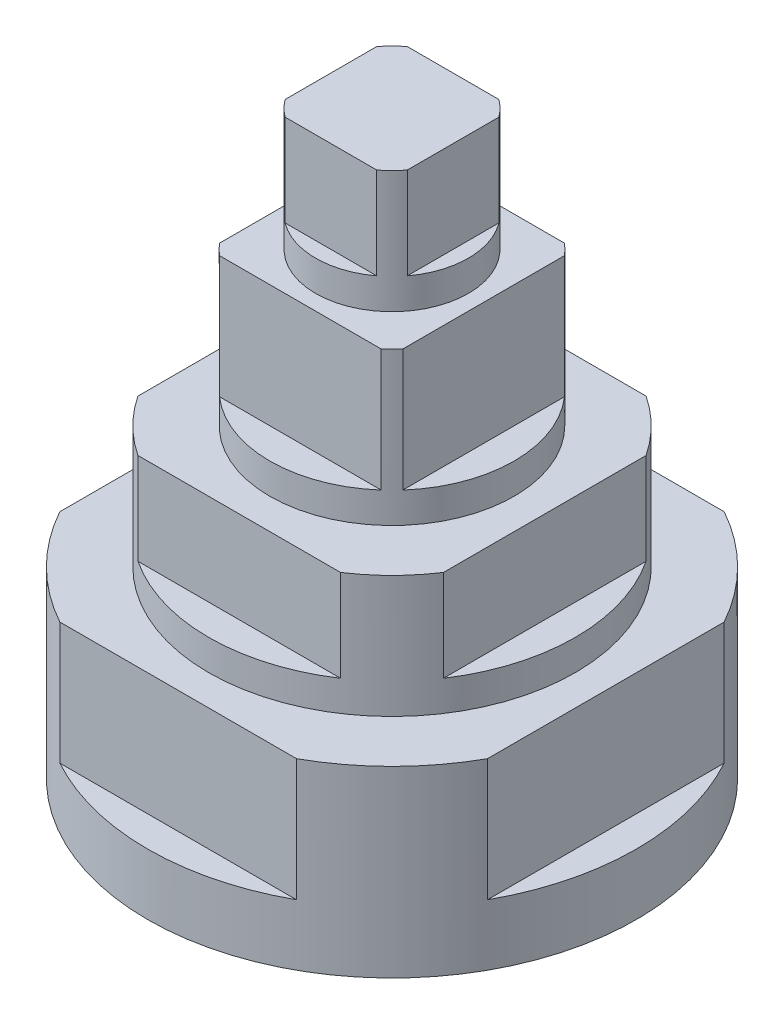
ISO-10303-21;
HEADER;
FILE_DESCRIPTION(('STEP AP214'),'2;1');
FILE_NAME('part.step','',(''),(''),'','','');
FILE_SCHEMA(('AUTOMOTIVE_DESIGN { 1 0 10303 214 1 1 1 1 }'));
ENDSEC;
DATA;
#1=APPLICATION_CONTEXT('core data for automotive mechanical design processes');
#2=APPLICATION_PROTOCOL_DEFINITION('international standard','automotive_design',2000,#1);
#3=PRODUCT_CONTEXT('',#1,'mechanical');
#4=PRODUCT('Part','Part','',(#3));
#5=PRODUCT_RELATED_PRODUCT_CATEGORY('part','',(#4));
#6=PRODUCT_DEFINITION_FORMATION('','',#4);
#7=PRODUCT_DEFINITION_CONTEXT('part definition',#1,'design');
#8=PRODUCT_DEFINITION('design','',#6,#7);
#9=PRODUCT_DEFINITION_SHAPE('','',#8);
#10=(LENGTH_UNIT() NAMED_UNIT(*) SI_UNIT(.MILLI.,.METRE.));
#11=(NAMED_UNIT(*) PLANE_ANGLE_UNIT() SI_UNIT($,.RADIAN.));
#12=(NAMED_UNIT(*) SI_UNIT($,.STERADIAN.) SOLID_ANGLE_UNIT());
#13=UNCERTAINTY_MEASURE_WITH_UNIT(LENGTH_MEASURE(1.E-05),#10,'distance_accuracy_value','');
#14=(GEOMETRIC_REPRESENTATION_CONTEXT(3) GLOBAL_UNCERTAINTY_ASSIGNED_CONTEXT((#13)) GLOBAL_UNIT_ASSIGNED_CONTEXT((#10,
#11,#12)) REPRESENTATION_CONTEXT('',''));
#15=CARTESIAN_POINT('',(0.,0.,0.));
#16=DIRECTION('',(0.,0.,1.));
#17=DIRECTION('',(1.,0.,0.));
#18=AXIS2_PLACEMENT_3D('',#15,#16,#17);
#19=CARTESIAN_POINT('',(0.,50.,0.));
#20=DIRECTION('',(0.,-1.,0.));
#21=DIRECTION('',(0.,0.,-1.));
#22=AXIS2_PLACEMENT_3D('',#19,#20,#21);
#23=CYLINDRICAL_SURFACE('',#22,30.);
#24=CARTESIAN_POINT('',(0.,30.,0.));
#25=DIRECTION('',(0.,1.,0.));
#26=DIRECTION('',(0.,0.,1.));
#27=AXIS2_PLACEMENT_3D('',#24,#25,#26);
#28=CIRCLE('',#27,30.);
#29=CARTESIAN_POINT('',(0.,30.,30.));
#30=VERTEX_POINT('',#29);
#31=EDGE_CURVE('E276',#30,#30,#28,.T.);
#32=ORIENTED_EDGE('',*,*,#31,.T.);
#33=EDGE_LOOP('',(#32));
#34=FACE_BOUND('',#33,.T.);
#35=DIRECTION('',(0.,-1.,0.));
#36=VECTOR('',#35,1.);
#37=CARTESIAN_POINT('',(16.583123951777,50.,-25.));
#38=LINE('',#37,#36);
#39=CARTESIAN_POINT('',(16.583123951777,50.,-25.));
#40=VERTEX_POINT('',#39);
#41=CARTESIAN_POINT('',(16.583123951777,35.,-25.));
#42=VERTEX_POINT('',#41);
#43=EDGE_CURVE('E466',#40,#42,#38,.T.);
#44=ORIENTED_EDGE('',*,*,#43,.F.);
#45=CARTESIAN_POINT('',(0.,50.,0.));
#46=DIRECTION('',(0.,1.,0.));
#47=DIRECTION('',(0.,0.,1.));
#48=AXIS2_PLACEMENT_3D('',#45,#46,#47);
#49=CIRCLE('',#48,30.);
#50=CARTESIAN_POINT('',(25.0000000000001,50.,-16.5831239517769));
#51=VERTEX_POINT('',#50);
#52=EDGE_CURVE('E299',#51,#40,#49,.T.);
#53=ORIENTED_EDGE('',*,*,#52,.F.);
#54=DIRECTION('',(0.,-1.,0.));
#55=VECTOR('',#54,1.);
#56=CARTESIAN_POINT('',(25.0000000000001,50.,-16.5831239517769));
#57=LINE('',#56,#55);
#58=CARTESIAN_POINT('',(25.0000000000001,35.,-16.5831239517769));
#59=VERTEX_POINT('',#58);
#60=EDGE_CURVE('E457',#59,#51,#57,.F.);
#61=ORIENTED_EDGE('',*,*,#60,.F.);
#62=CARTESIAN_POINT('',(0.,35.,0.));
#63=DIRECTION('',(0.,1.,0.));
#64=DIRECTION('',(0.,0.,1.));
#65=AXIS2_PLACEMENT_3D('',#62,#63,#64);
#66=CIRCLE('',#65,30.);
#67=CARTESIAN_POINT('',(25.,35.,16.5831239517771));
#68=VERTEX_POINT('',#67);
#69=EDGE_CURVE('E373',#68,#59,#66,.T.);
#70=ORIENTED_EDGE('',*,*,#69,.F.);
#71=DIRECTION('',(0.,-1.,0.));
#72=VECTOR('',#71,1.);
#73=CARTESIAN_POINT('',(25.,50.,16.5831239517771));
#74=LINE('',#73,#72);
#75=CARTESIAN_POINT('',(25.,50.,16.5831239517771));
#76=VERTEX_POINT('',#75);
#77=EDGE_CURVE('E460',#76,#68,#74,.T.);
#78=ORIENTED_EDGE('',*,*,#77,.F.);
#79=CARTESIAN_POINT('',(16.5831239517768,50.,25.0000000000001));
#80=VERTEX_POINT('',#79);
#81=EDGE_CURVE('E295',#80,#76,#49,.T.);
#82=ORIENTED_EDGE('',*,*,#81,.F.);
#83=DIRECTION('',(0.,-1.,0.));
#84=VECTOR('',#83,1.);
#85=CARTESIAN_POINT('',(16.5831239517768,50.,25.0000000000001));
#86=LINE('',#85,#84);
#87=CARTESIAN_POINT('',(16.5831239517768,35.,25.0000000000001));
#88=VERTEX_POINT('',#87);
#89=EDGE_CURVE('E451',#88,#80,#86,.F.);
#90=ORIENTED_EDGE('',*,*,#89,.F.);
#91=CARTESIAN_POINT('',(0.,35.,0.));
#92=DIRECTION('',(0.,1.,0.));
#93=DIRECTION('',(0.,0.,1.));
#94=AXIS2_PLACEMENT_3D('',#91,#92,#93);
#95=CIRCLE('',#94,30.);
#96=CARTESIAN_POINT('',(-16.5831239517772,35.,24.9999999999999));
#97=VERTEX_POINT('',#96);
#98=EDGE_CURVE('E370',#97,#88,#95,.T.);
#99=ORIENTED_EDGE('',*,*,#98,.F.);
#100=DIRECTION('',(0.,-1.,0.));
#101=VECTOR('',#100,1.);
#102=CARTESIAN_POINT('',(-16.5831239517772,50.,24.9999999999999));
#103=LINE('',#102,#101);
#104=CARTESIAN_POINT('',(-16.5831239517772,50.,24.9999999999999));
#105=VERTEX_POINT('',#104);
#106=EDGE_CURVE('E454',#105,#97,#103,.T.);
#107=ORIENTED_EDGE('',*,*,#106,.F.);
#108=CARTESIAN_POINT('',(-25.0000000000002,50.,16.5831239517767));
#109=VERTEX_POINT('',#108);
#110=EDGE_CURVE('E301',#109,#105,#49,.T.);
#111=ORIENTED_EDGE('',*,*,#110,.F.);
#112=DIRECTION('',(0.,-1.,0.));
#113=VECTOR('',#112,1.);
#114=CARTESIAN_POINT('',(-25.0000000000002,50.,16.5831239517767));
#115=LINE('',#114,#113);
#116=CARTESIAN_POINT('',(-25.0000000000002,35.,16.5831239517767));
#117=VERTEX_POINT('',#116);
#118=EDGE_CURVE('E434',#117,#109,#115,.F.);
#119=ORIENTED_EDGE('',*,*,#118,.F.);
#120=CARTESIAN_POINT('',(0.,35.,0.));
#121=DIRECTION('',(0.,1.,0.));
#122=DIRECTION('',(0.,0.,1.));
#123=AXIS2_PLACEMENT_3D('',#120,#121,#122);
#124=CIRCLE('',#123,30.);
#125=CARTESIAN_POINT('',(-24.9999999999998,35.,-16.5831239517772));
#126=VERTEX_POINT('',#125);
#127=EDGE_CURVE('E367',#126,#117,#124,.T.);
#128=ORIENTED_EDGE('',*,*,#127,.F.);
#129=DIRECTION('',(0.,-1.,0.));
#130=VECTOR('',#129,1.);
#131=CARTESIAN_POINT('',(-24.9999999999998,50.,-16.5831239517772));
#132=LINE('',#131,#130);
#133=CARTESIAN_POINT('',(-24.9999999999998,50.,-16.5831239517772));
#134=VERTEX_POINT('',#133);
#135=EDGE_CURVE('E448',#134,#126,#132,.T.);
#136=ORIENTED_EDGE('',*,*,#135,.F.);
#137=CARTESIAN_POINT('',(-16.583123951777,50.,-25.));
#138=VERTEX_POINT('',#137);
#139=EDGE_CURVE('E592',#138,#134,#49,.T.);
#140=ORIENTED_EDGE('',*,*,#139,.F.);
#141=DIRECTION('',(0.,-1.,0.));
#142=VECTOR('',#141,1.);
#143=CARTESIAN_POINT('',(-16.583123951777,50.,-25.));
#144=LINE('',#143,#142);
#145=CARTESIAN_POINT('',(-16.583123951777,35.,-25.));
#146=VERTEX_POINT('',#145);
#147=EDGE_CURVE('E463',#146,#138,#144,.F.);
#148=ORIENTED_EDGE('',*,*,#147,.F.);
#149=CARTESIAN_POINT('',(0.,35.,0.));
#150=DIRECTION('',(0.,1.,0.));
#151=DIRECTION('',(0.,0.,1.));
#152=AXIS2_PLACEMENT_3D('',#149,#150,#151);
#153=CIRCLE('',#152,30.);
#154=EDGE_CURVE('E376',#42,#146,#153,.T.);
#155=ORIENTED_EDGE('',*,*,#154,.F.);
#156=EDGE_LOOP('',(#44,#53,#61,#70,#78,#82,#90,#99,#107,#111,#119,#128,#136,#140,#148,#155));
#157=FACE_BOUND('',#156,.T.);
#158=ADVANCED_FACE('F40',(#34,#157),#23,.T.);
#159=CARTESIAN_POINT('',(0.,50.,0.));
#160=DIRECTION('',(0.,1.,0.));
#161=DIRECTION('',(0.,0.,1.));
#162=AXIS2_PLACEMENT_3D('',#159,#160,#161);
#163=PLANE('',#162);
#164=CARTESIAN_POINT('',(0.,50.,0.));
#165=DIRECTION('',(0.,1.,0.));
#166=DIRECTION('',(0.,0.,1.));
#167=AXIS2_PLACEMENT_3D('',#164,#165,#166);
#168=CIRCLE('',#167,20.);
#169=CARTESIAN_POINT('',(0.,50.,20.));
#170=VERTEX_POINT('',#169);
#171=EDGE_CURVE('E283',#170,#170,#168,.T.);
#172=ORIENTED_EDGE('',*,*,#171,.F.);
#173=EDGE_LOOP('',(#172));
#174=FACE_BOUND('',#173,.T.);
#175=ORIENTED_EDGE('',*,*,#52,.T.);
#176=DIRECTION('',(-1.,0.,0.));
#177=VECTOR('',#176,1.);
#178=CARTESIAN_POINT('',(0.,50.,-25.));
#179=LINE('',#178,#177);
#180=EDGE_CURVE('E363',#40,#138,#179,.T.);
#181=ORIENTED_EDGE('',*,*,#180,.T.);
#182=ORIENTED_EDGE('',*,*,#139,.T.);
#183=DIRECTION('',(0.,0.,1.));
#184=VECTOR('',#183,1.);
#185=CARTESIAN_POINT('',(-25.,50.,-2.5583747292647E-13));
#186=LINE('',#185,#184);
#187=EDGE_CURVE('E351',#134,#109,#186,.T.);
#188=ORIENTED_EDGE('',*,*,#187,.T.);
#189=ORIENTED_EDGE('',*,*,#110,.T.);
#190=DIRECTION('',(1.,0.,0.));
#191=VECTOR('',#190,1.);
#192=CARTESIAN_POINT('',(-1.68817924312024E-13,50.,25.));
#193=LINE('',#192,#191);
#194=EDGE_CURVE('E355',#105,#80,#193,.T.);
#195=ORIENTED_EDGE('',*,*,#194,.T.);
#196=ORIENTED_EDGE('',*,*,#81,.T.);
#197=DIRECTION('',(0.,0.,-1.));
#198=VECTOR('',#197,1.);
#199=CARTESIAN_POINT('',(25.,50.,0.));
#200=LINE('',#199,#198);
#201=EDGE_CURVE('E359',#76,#51,#200,.T.);
#202=ORIENTED_EDGE('',*,*,#201,.T.);
#203=EDGE_LOOP('',(#175,#181,#182,#188,#189,#195,#196,#202));
#204=FACE_BOUND('',#203,.T.);
#205=ADVANCED_FACE('F579',(#174,#204),#163,.T.);
#206=CARTESIAN_POINT('',(0.,95.,0.));
#207=DIRECTION('',(0.,-1.,0.));
#208=DIRECTION('',(0.,0.,-1.));
#209=AXIS2_PLACEMENT_3D('',#206,#207,#208);
#210=CYLINDRICAL_SURFACE('',#209,12.5);
#211=CARTESIAN_POINT('',(0.,75.,0.));
#212=DIRECTION('',(0.,1.,0.));
#213=DIRECTION('',(0.,0.,1.));
#214=AXIS2_PLACEMENT_3D('',#211,#212,#213);
#215=CIRCLE('',#214,12.5);
#216=CARTESIAN_POINT('',(0.,75.,12.5));
#217=VERTEX_POINT('',#216);
#218=EDGE_CURVE('E308',#217,#217,#215,.T.);
#219=ORIENTED_EDGE('',*,*,#218,.T.);
#220=EDGE_LOOP('',(#219));
#221=FACE_BOUND('',#220,.T.);
#222=DIRECTION('',(0.,-1.,0.));
#223=VECTOR('',#222,1.);
#224=CARTESIAN_POINT('',(10.,95.,7.5));
#225=LINE('',#224,#223);
#226=CARTESIAN_POINT('',(10.,95.,7.5));
#227=VERTEX_POINT('',#226);
#228=CARTESIAN_POINT('',(10.,80.,7.5));
#229=VERTEX_POINT('',#228);
#230=EDGE_CURVE('E554',#227,#229,#225,.T.);
#231=ORIENTED_EDGE('',*,*,#230,.F.);
#232=CARTESIAN_POINT('',(0.,95.,0.));
#233=DIRECTION('',(0.,1.,0.));
#234=DIRECTION('',(0.,0.,1.));
#235=AXIS2_PLACEMENT_3D('',#232,#233,#234);
#236=CIRCLE('',#235,12.5);
#237=CARTESIAN_POINT('',(7.5,95.,10.));
#238=VERTEX_POINT('',#237);
#239=EDGE_CURVE('E558',#238,#227,#236,.T.);
#240=ORIENTED_EDGE('',*,*,#239,.F.);
#241=DIRECTION('',(0.,-1.,0.));
#242=VECTOR('',#241,1.);
#243=CARTESIAN_POINT('',(7.5,95.,10.));
#244=LINE('',#243,#242);
#245=CARTESIAN_POINT('',(7.5,80.,10.));
#246=VERTEX_POINT('',#245);
#247=EDGE_CURVE('E545',#246,#238,#244,.F.);
#248=ORIENTED_EDGE('',*,*,#247,.F.);
#249=CARTESIAN_POINT('',(0.,80.,0.));
#250=DIRECTION('',(0.,1.,0.));
#251=DIRECTION('',(0.,0.,1.));
#252=AXIS2_PLACEMENT_3D('',#249,#250,#251);
#253=CIRCLE('',#252,12.5);
#254=CARTESIAN_POINT('',(-7.5,80.,10.));
#255=VERTEX_POINT('',#254);
#256=EDGE_CURVE('E1024',#255,#246,#253,.T.);
#257=ORIENTED_EDGE('',*,*,#256,.F.);
#258=DIRECTION('',(0.,-1.,0.));
#259=VECTOR('',#258,1.);
#260=CARTESIAN_POINT('',(-7.5,95.,10.));
#261=LINE('',#260,#259);
#262=CARTESIAN_POINT('',(-7.5,95.,10.));
#263=VERTEX_POINT('',#262);
#264=EDGE_CURVE('E548',#263,#255,#261,.T.);
#265=ORIENTED_EDGE('',*,*,#264,.F.);
#266=CARTESIAN_POINT('',(-10.,95.,7.5));
#267=VERTEX_POINT('',#266);
#268=EDGE_CURVE('E557',#267,#263,#236,.T.);
#269=ORIENTED_EDGE('',*,*,#268,.F.);
#270=DIRECTION('',(0.,-1.,0.));
#271=VECTOR('',#270,1.);
#272=CARTESIAN_POINT('',(-10.,95.,7.5));
#273=LINE('',#272,#271);
#274=CARTESIAN_POINT('',(-10.,80.,7.5));
#275=VERTEX_POINT('',#274);
#276=EDGE_CURVE('E539',#275,#267,#273,.F.);
#277=ORIENTED_EDGE('',*,*,#276,.F.);
#278=CARTESIAN_POINT('',(-10.,80.,-7.5));
#279=VERTEX_POINT('',#278);
#280=EDGE_CURVE('E323',#279,#275,#253,.T.);
#281=ORIENTED_EDGE('',*,*,#280,.F.);
#282=DIRECTION('',(0.,-1.,0.));
#283=VECTOR('',#282,1.);
#284=CARTESIAN_POINT('',(-10.,95.,-7.5));
#285=LINE('',#284,#283);
#286=CARTESIAN_POINT('',(-10.,95.,-7.5));
#287=VERTEX_POINT('',#286);
#288=EDGE_CURVE('E542',#287,#279,#285,.T.);
#289=ORIENTED_EDGE('',*,*,#288,.F.);
#290=CARTESIAN_POINT('',(-7.5,95.,-10.));
#291=VERTEX_POINT('',#290);
#292=EDGE_CURVE('E1039',#291,#287,#236,.T.);
#293=ORIENTED_EDGE('',*,*,#292,.F.);
#294=DIRECTION('',(0.,-1.,0.));
#295=VECTOR('',#294,1.);
#296=CARTESIAN_POINT('',(-7.5,95.,-10.));
#297=LINE('',#296,#295);
#298=CARTESIAN_POINT('',(-7.5,80.,-10.));
#299=VERTEX_POINT('',#298);
#300=EDGE_CURVE('E533',#299,#291,#297,.F.);
#301=ORIENTED_EDGE('',*,*,#300,.F.);
#302=CARTESIAN_POINT('',(7.5,80.,-10.));
#303=VERTEX_POINT('',#302);
#304=EDGE_CURVE('E320',#303,#299,#253,.T.);
#305=ORIENTED_EDGE('',*,*,#304,.F.);
#306=DIRECTION('',(0.,-1.,0.));
#307=VECTOR('',#306,1.);
#308=CARTESIAN_POINT('',(7.5,95.,-10.));
#309=LINE('',#308,#307);
#310=CARTESIAN_POINT('',(7.5,95.,-10.));
#311=VERTEX_POINT('',#310);
#312=EDGE_CURVE('E536',#311,#303,#309,.T.);
#313=ORIENTED_EDGE('',*,*,#312,.F.);
#314=CARTESIAN_POINT('',(10.,95.,-7.5));
#315=VERTEX_POINT('',#314);
#316=EDGE_CURVE('E563',#315,#311,#236,.T.);
#317=ORIENTED_EDGE('',*,*,#316,.F.);
#318=DIRECTION('',(0.,-1.,0.));
#319=VECTOR('',#318,1.);
#320=CARTESIAN_POINT('',(10.,95.,-7.5));
#321=LINE('',#320,#319);
#322=CARTESIAN_POINT('',(10.,80.,-7.5));
#323=VERTEX_POINT('',#322);
#324=EDGE_CURVE('E551',#323,#315,#321,.F.);
#325=ORIENTED_EDGE('',*,*,#324,.F.);
#326=EDGE_CURVE('E324',#229,#323,#253,.T.);
#327=ORIENTED_EDGE('',*,*,#326,.F.);
#328=EDGE_LOOP('',(#231,#240,#248,#257,#265,#269,#277,#281,#289,#293,#301,#305,#313,#317,#325,#327));
#329=FACE_BOUND('',#328,.T.);
#330=ADVANCED_FACE('F582',(#221,#329),#210,.T.);
#331=CARTESIAN_POINT('',(0.,95.,0.));
#332=DIRECTION('',(0.,1.,0.));
#333=DIRECTION('',(0.,0.,1.));
#334=AXIS2_PLACEMENT_3D('',#331,#332,#333);
#335=PLANE('',#334);
#336=ORIENTED_EDGE('',*,*,#239,.T.);
#337=DIRECTION('',(0.,0.,-1.));
#338=VECTOR('',#337,1.);
#339=CARTESIAN_POINT('',(10.,95.,0.));
#340=LINE('',#339,#338);
#341=EDGE_CURVE('E316',#227,#315,#340,.T.);
#342=ORIENTED_EDGE('',*,*,#341,.T.);
#343=ORIENTED_EDGE('',*,*,#316,.T.);
#344=DIRECTION('',(-1.,0.,0.));
#345=VECTOR('',#344,1.);
#346=CARTESIAN_POINT('',(0.,95.,-10.));
#347=LINE('',#346,#345);
#348=EDGE_CURVE('E303',#311,#291,#347,.T.);
#349=ORIENTED_EDGE('',*,*,#348,.T.);
#350=ORIENTED_EDGE('',*,*,#292,.T.);
#351=DIRECTION('',(0.,0.,1.));
#352=VECTOR('',#351,1.);
#353=CARTESIAN_POINT('',(-10.,95.,0.));
#354=LINE('',#353,#352);
#355=EDGE_CURVE('E307',#287,#267,#354,.T.);
#356=ORIENTED_EDGE('',*,*,#355,.T.);
#357=ORIENTED_EDGE('',*,*,#268,.T.);
#358=DIRECTION('',(1.,0.,0.));
#359=VECTOR('',#358,1.);
#360=CARTESIAN_POINT('',(0.,95.,10.));
#361=LINE('',#360,#359);
#362=EDGE_CURVE('E312',#263,#238,#361,.T.);
#363=ORIENTED_EDGE('',*,*,#362,.T.);
#364=EDGE_LOOP('',(#336,#342,#343,#349,#350,#356,#357,#363));
#365=FACE_BOUND('',#364,.T.);
#366=ADVANCED_FACE('F647',(#365),#335,.T.);
#367=CARTESIAN_POINT('',(0.,30.,0.));
#368=DIRECTION('',(0.,-1.,0.));
#369=DIRECTION('',(0.,0.,-1.));
#370=AXIS2_PLACEMENT_3D('',#367,#368,#369);
#371=CYLINDRICAL_SURFACE('',#370,40.);
#372=CARTESIAN_POINT('',(0.,30.,0.));
#373=DIRECTION('',(0.,1.,0.));
#374=DIRECTION('',(0.,0.,1.));
#375=AXIS2_PLACEMENT_3D('',#372,#373,#374);
#376=CIRCLE('',#375,40.);
#377=CARTESIAN_POINT('',(-35.0000000000002,30.,19.3649167310367));
#378=VERTEX_POINT('',#377);
#379=CARTESIAN_POINT('',(-19.3649167310373,30.,34.9999999999999));
#380=VERTEX_POINT('',#379);
#381=EDGE_CURVE('E285',#378,#380,#376,.T.);
#382=ORIENTED_EDGE('',*,*,#381,.F.);
#383=DIRECTION('',(0.,-1.,0.));
#384=VECTOR('',#383,1.);
#385=CARTESIAN_POINT('',(-35.0000000000002,30.,19.3649167310367));
#386=LINE('',#385,#384);
#387=CARTESIAN_POINT('',(-35.0000000000002,10.,19.3649167310367));
#388=VERTEX_POINT('',#387);
#389=EDGE_CURVE('E64',#378,#388,#386,.T.);
#390=ORIENTED_EDGE('',*,*,#389,.T.);
#391=CARTESIAN_POINT('',(0.,10.,0.));
#392=DIRECTION('',(0.,1.,0.));
#393=DIRECTION('',(0.,0.,1.));
#394=AXIS2_PLACEMENT_3D('',#391,#392,#393);
#395=CIRCLE('',#394,40.);
#396=CARTESIAN_POINT('',(-34.9999999999998,10.,-19.3649167310375));
#397=VERTEX_POINT('',#396);
#398=EDGE_CURVE('E12',#397,#388,#395,.T.);
#399=ORIENTED_EDGE('',*,*,#398,.F.);
#400=DIRECTION('',(0.,-1.,0.));
#401=VECTOR('',#400,1.);
#402=CARTESIAN_POINT('',(-34.9999999999998,30.,-19.3649167310375));
#403=LINE('',#402,#401);
#404=CARTESIAN_POINT('',(-34.9999999999998,30.,-19.3649167310375));
#405=VERTEX_POINT('',#404);
#406=EDGE_CURVE('E399',#397,#405,#403,.F.);
#407=ORIENTED_EDGE('',*,*,#406,.T.);
#408=CARTESIAN_POINT('',(-19.3649167310371,30.,-35.));
#409=VERTEX_POINT('',#408);
#410=EDGE_CURVE('E279',#409,#405,#376,.T.);
#411=ORIENTED_EDGE('',*,*,#410,.F.);
#412=DIRECTION('',(0.,-1.,0.));
#413=VECTOR('',#412,1.);
#414=CARTESIAN_POINT('',(-19.3649167310371,30.,-35.));
#415=LINE('',#414,#413);
#416=CARTESIAN_POINT('',(-19.3649167310371,10.,-35.));
#417=VERTEX_POINT('',#416);
#418=EDGE_CURVE('E425',#409,#417,#415,.T.);
#419=ORIENTED_EDGE('',*,*,#418,.T.);
#420=CARTESIAN_POINT('',(0.,10.,0.));
#421=DIRECTION('',(0.,1.,0.));
#422=DIRECTION('',(0.,0.,1.));
#423=AXIS2_PLACEMENT_3D('',#420,#421,#422);
#424=CIRCLE('',#423,40.);
#425=CARTESIAN_POINT('',(19.3649167310371,10.,-35.));
#426=VERTEX_POINT('',#425);
#427=EDGE_CURVE('E258',#426,#417,#424,.T.);
#428=ORIENTED_EDGE('',*,*,#427,.F.);
#429=DIRECTION('',(0.,-1.,0.));
#430=VECTOR('',#429,1.);
#431=CARTESIAN_POINT('',(19.3649167310371,30.,-35.));
#432=LINE('',#431,#430);
#433=CARTESIAN_POINT('',(19.3649167310371,30.,-35.));
#434=VERTEX_POINT('',#433);
#435=EDGE_CURVE('E422',#426,#434,#432,.F.);
#436=ORIENTED_EDGE('',*,*,#435,.T.);
#437=CARTESIAN_POINT('',(35.0000000000001,30.,-19.364916731037));
#438=VERTEX_POINT('',#437);
#439=EDGE_CURVE('E277',#438,#434,#376,.T.);
#440=ORIENTED_EDGE('',*,*,#439,.F.);
#441=DIRECTION('',(0.,-1.,0.));
#442=VECTOR('',#441,1.);
#443=CARTESIAN_POINT('',(35.0000000000001,30.,-19.364916731037));
#444=LINE('',#443,#442);
#445=CARTESIAN_POINT('',(35.0000000000001,10.,-19.364916731037));
#446=VERTEX_POINT('',#445);
#447=EDGE_CURVE('E56',#438,#446,#444,.T.);
#448=ORIENTED_EDGE('',*,*,#447,.T.);
#449=CARTESIAN_POINT('',(0.,10.,0.));
#450=DIRECTION('',(0.,1.,0.));
#451=DIRECTION('',(0.,0.,1.));
#452=AXIS2_PLACEMENT_3D('',#449,#450,#451);
#453=CIRCLE('',#452,40.);
#454=CARTESIAN_POINT('',(34.9999999999999,10.,19.3649167310372));
#455=VERTEX_POINT('',#454);
#456=EDGE_CURVE('E49',#455,#446,#453,.T.);
#457=ORIENTED_EDGE('',*,*,#456,.F.);
#458=DIRECTION('',(0.,-1.,0.));
#459=VECTOR('',#458,1.);
#460=CARTESIAN_POINT('',(34.9999999999999,30.,19.3649167310372));
#461=LINE('',#460,#459);
#462=CARTESIAN_POINT('',(34.9999999999999,30.,19.3649167310372));
#463=VERTEX_POINT('',#462);
#464=EDGE_CURVE('E251',#455,#463,#461,.F.);
#465=ORIENTED_EDGE('',*,*,#464,.T.);
#466=CARTESIAN_POINT('',(19.3649167310368,30.,35.0000000000001));
#467=VERTEX_POINT('',#466);
#468=EDGE_CURVE('E266',#467,#463,#376,.T.);
#469=ORIENTED_EDGE('',*,*,#468,.F.);
#470=DIRECTION('',(0.,-1.,0.));
#471=VECTOR('',#470,1.);
#472=CARTESIAN_POINT('',(19.3649167310368,30.,35.0000000000001));
#473=LINE('',#472,#471);
#474=CARTESIAN_POINT('',(19.3649167310368,10.,35.0000000000001));
#475=VERTEX_POINT('',#474);
#476=EDGE_CURVE('E419',#467,#475,#473,.T.);
#477=ORIENTED_EDGE('',*,*,#476,.T.);
#478=CARTESIAN_POINT('',(0.,10.,0.));
#479=DIRECTION('',(0.,1.,0.));
#480=DIRECTION('',(0.,0.,1.));
#481=AXIS2_PLACEMENT_3D('',#478,#479,#480);
#482=CIRCLE('',#481,40.);
#483=CARTESIAN_POINT('',(-19.3649167310373,10.,34.9999999999999));
#484=VERTEX_POINT('',#483);
#485=EDGE_CURVE('E385',#484,#475,#482,.T.);
#486=ORIENTED_EDGE('',*,*,#485,.F.);
#487=DIRECTION('',(0.,-1.,0.));
#488=VECTOR('',#487,1.);
#489=CARTESIAN_POINT('',(-19.3649167310373,30.,34.9999999999999));
#490=LINE('',#489,#488);
#491=EDGE_CURVE('E412',#484,#380,#490,.F.);
#492=ORIENTED_EDGE('',*,*,#491,.T.);
#493=EDGE_LOOP('',(#382,#390,#399,#407,#411,#419,#428,#436,#440,#448,#457,#465,#469,#477,#486,#492));
#494=FACE_BOUND('',#493,.T.);
#495=CARTESIAN_POINT('',(0.,0.,0.));
#496=DIRECTION('',(0.,1.,0.));
#497=DIRECTION('',(0.,0.,1.));
#498=AXIS2_PLACEMENT_3D('',#495,#496,#497);
#499=CIRCLE('',#498,40.);
#500=CARTESIAN_POINT('',(0.,0.,40.));
#501=VERTEX_POINT('',#500);
#502=EDGE_CURVE('E292',#501,#501,#499,.T.);
#503=ORIENTED_EDGE('',*,*,#502,.T.);
#504=EDGE_LOOP('',(#503));
#505=FACE_BOUND('',#504,.T.);
#506=ADVANCED_FACE('F42',(#494,#505),#371,.T.);
#507=CARTESIAN_POINT('',(0.,30.,0.));
#508=DIRECTION('',(0.,1.,0.));
#509=DIRECTION('',(0.,0.,1.));
#510=AXIS2_PLACEMENT_3D('',#507,#508,#509);
#511=PLANE('',#510);
#512=DIRECTION('',(0.,0.,-1.));
#513=VECTOR('',#512,1.);
#514=CARTESIAN_POINT('',(-35.,30.,-3.67279728687572E-13));
#515=LINE('',#514,#513);
#516=EDGE_CURVE('E257',#378,#405,#515,.T.);
#517=ORIENTED_EDGE('',*,*,#516,.F.);
#518=ORIENTED_EDGE('',*,*,#381,.T.);
#519=DIRECTION('',(-1.,0.,0.));
#520=VECTOR('',#519,1.);
#521=CARTESIAN_POINT('',(-2.44853152458381E-13,30.,35.));
#522=LINE('',#521,#520);
#523=EDGE_CURVE('E274',#467,#380,#522,.T.);
#524=ORIENTED_EDGE('',*,*,#523,.F.);
#525=ORIENTED_EDGE('',*,*,#468,.T.);
#526=DIRECTION('',(0.,0.,1.));
#527=VECTOR('',#526,1.);
#528=CARTESIAN_POINT('',(35.,30.,1.22426576229191E-13));
#529=LINE('',#528,#527);
#530=EDGE_CURVE('E248',#438,#463,#529,.T.);
#531=ORIENTED_EDGE('',*,*,#530,.F.);
#532=ORIENTED_EDGE('',*,*,#439,.T.);
#533=DIRECTION('',(1.,0.,0.));
#534=VECTOR('',#533,1.);
#535=CARTESIAN_POINT('',(0.,30.,-35.));
#536=LINE('',#535,#534);
#537=EDGE_CURVE('E381',#409,#434,#536,.T.);
#538=ORIENTED_EDGE('',*,*,#537,.F.);
#539=ORIENTED_EDGE('',*,*,#410,.T.);
#540=EDGE_LOOP('',(#517,#518,#524,#525,#531,#532,#538,#539));
#541=FACE_BOUND('',#540,.T.);
#542=ORIENTED_EDGE('',*,*,#31,.F.);
#543=EDGE_LOOP('',(#542));
#544=FACE_BOUND('',#543,.T.);
#545=ADVANCED_FACE('F271',(#541,#544),#511,.T.);
#546=CARTESIAN_POINT('',(0.,0.,0.));
#547=DIRECTION('',(0.,1.,0.));
#548=DIRECTION('',(0.,0.,1.));
#549=AXIS2_PLACEMENT_3D('',#546,#547,#548);
#550=PLANE('',#549);
#551=ORIENTED_EDGE('',*,*,#502,.F.);
#552=EDGE_LOOP('',(#551));
#553=FACE_BOUND('',#552,.T.);
#554=ADVANCED_FACE('F629',(#553),#550,.F.);
#555=CARTESIAN_POINT('',(0.,75.,0.));
#556=DIRECTION('',(0.,-1.,0.));
#557=DIRECTION('',(0.,0.,-1.));
#558=AXIS2_PLACEMENT_3D('',#555,#556,#557);
#559=CYLINDRICAL_SURFACE('',#558,20.);
#560=CARTESIAN_POINT('',(0.,75.,0.));
#561=DIRECTION('',(0.,1.,0.));
#562=DIRECTION('',(0.,0.,1.));
#563=AXIS2_PLACEMENT_3D('',#560,#561,#562);
#564=CIRCLE('',#563,20.);
#565=CARTESIAN_POINT('',(-15.,75.,13.228756555323));
#566=VERTEX_POINT('',#565);
#567=CARTESIAN_POINT('',(-13.228756555323,75.,15.));
#568=VERTEX_POINT('',#567);
#569=EDGE_CURVE('E562',#566,#568,#564,.T.);
#570=ORIENTED_EDGE('',*,*,#569,.F.);
#571=DIRECTION('',(0.,-1.,0.));
#572=VECTOR('',#571,1.);
#573=CARTESIAN_POINT('',(-15.,75.,13.228756555323));
#574=LINE('',#573,#572);
#575=CARTESIAN_POINT('',(-15.,55.,13.228756555323));
#576=VERTEX_POINT('',#575);
#577=EDGE_CURVE('E477',#566,#576,#574,.T.);
#578=ORIENTED_EDGE('',*,*,#577,.T.);
#579=CARTESIAN_POINT('',(0.,55.,0.));
#580=DIRECTION('',(0.,1.,0.));
#581=DIRECTION('',(0.,0.,1.));
#582=AXIS2_PLACEMENT_3D('',#579,#580,#581);
#583=CIRCLE('',#582,20.);
#584=CARTESIAN_POINT('',(-15.,55.,-13.228756555323));
#585=VERTEX_POINT('',#584);
#586=EDGE_CURVE('E348',#585,#576,#583,.T.);
#587=ORIENTED_EDGE('',*,*,#586,.F.);
#588=DIRECTION('',(0.,-1.,0.));
#589=VECTOR('',#588,1.);
#590=CARTESIAN_POINT('',(-15.,75.,-13.228756555323));
#591=LINE('',#590,#589);
#592=CARTESIAN_POINT('',(-15.,75.,-13.228756555323));
#593=VERTEX_POINT('',#592);
#594=EDGE_CURVE('E473',#585,#593,#591,.F.);
#595=ORIENTED_EDGE('',*,*,#594,.T.);
#596=CARTESIAN_POINT('',(-13.228756555323,75.,-15.));
#597=VERTEX_POINT('',#596);
#598=EDGE_CURVE('E572',#597,#593,#564,.T.);
#599=ORIENTED_EDGE('',*,*,#598,.F.);
#600=DIRECTION('',(0.,-1.,0.));
#601=VECTOR('',#600,1.);
#602=CARTESIAN_POINT('',(-13.228756555323,75.,-15.));
#603=LINE('',#602,#601);
#604=CARTESIAN_POINT('',(-13.228756555323,55.,-15.));
#605=VERTEX_POINT('',#604);
#606=EDGE_CURVE('E513',#597,#605,#603,.T.);
#607=ORIENTED_EDGE('',*,*,#606,.T.);
#608=CARTESIAN_POINT('',(0.,55.,0.));
#609=DIRECTION('',(0.,1.,0.));
#610=DIRECTION('',(0.,0.,1.));
#611=AXIS2_PLACEMENT_3D('',#608,#609,#610);
#612=CIRCLE('',#611,20.);
#613=CARTESIAN_POINT('',(13.228756555323,55.,-15.));
#614=VERTEX_POINT('',#613);
#615=EDGE_CURVE('E336',#614,#605,#612,.T.);
#616=ORIENTED_EDGE('',*,*,#615,.F.);
#617=DIRECTION('',(0.,-1.,0.));
#618=VECTOR('',#617,1.);
#619=CARTESIAN_POINT('',(13.228756555323,75.,-15.));
#620=LINE('',#619,#618);
#621=CARTESIAN_POINT('',(13.228756555323,75.,-15.));
#622=VERTEX_POINT('',#621);
#623=EDGE_CURVE('E509',#614,#622,#620,.F.);
#624=ORIENTED_EDGE('',*,*,#623,.T.);
#625=CARTESIAN_POINT('',(15.,75.,-13.228756555323));
#626=VERTEX_POINT('',#625);
#627=EDGE_CURVE('E571',#626,#622,#564,.T.);
#628=ORIENTED_EDGE('',*,*,#627,.F.);
#629=DIRECTION('',(0.,-1.,0.));
#630=VECTOR('',#629,1.);
#631=CARTESIAN_POINT('',(15.,75.,-13.228756555323));
#632=LINE('',#631,#630);
#633=CARTESIAN_POINT('',(15.,55.,-13.228756555323));
#634=VERTEX_POINT('',#633);
#635=EDGE_CURVE('E489',#626,#634,#632,.T.);
#636=ORIENTED_EDGE('',*,*,#635,.T.);
#637=CARTESIAN_POINT('',(0.,55.,0.));
#638=DIRECTION('',(0.,1.,0.));
#639=DIRECTION('',(0.,0.,1.));
#640=AXIS2_PLACEMENT_3D('',#637,#638,#639);
#641=CIRCLE('',#640,20.);
#642=CARTESIAN_POINT('',(15.,55.,13.228756555323));
#643=VERTEX_POINT('',#642);
#644=EDGE_CURVE('E342',#643,#634,#641,.T.);
#645=ORIENTED_EDGE('',*,*,#644,.F.);
#646=DIRECTION('',(0.,-1.,0.));
#647=VECTOR('',#646,1.);
#648=CARTESIAN_POINT('',(15.,75.,13.228756555323));
#649=LINE('',#648,#647);
#650=CARTESIAN_POINT('',(15.,75.,13.228756555323));
#651=VERTEX_POINT('',#650);
#652=EDGE_CURVE('E485',#643,#651,#649,.F.);
#653=ORIENTED_EDGE('',*,*,#652,.T.);
#654=CARTESIAN_POINT('',(13.228756555323,75.,15.));
#655=VERTEX_POINT('',#654);
#656=EDGE_CURVE('E567',#655,#651,#564,.T.);
#657=ORIENTED_EDGE('',*,*,#656,.F.);
#658=DIRECTION('',(0.,-1.,0.));
#659=VECTOR('',#658,1.);
#660=CARTESIAN_POINT('',(13.228756555323,75.,15.));
#661=LINE('',#660,#659);
#662=CARTESIAN_POINT('',(13.228756555323,55.,15.));
#663=VERTEX_POINT('',#662);
#664=EDGE_CURVE('E505',#655,#663,#661,.T.);
#665=ORIENTED_EDGE('',*,*,#664,.T.);
#666=CARTESIAN_POINT('',(0.,55.,0.));
#667=DIRECTION('',(0.,1.,0.));
#668=DIRECTION('',(0.,0.,1.));
#669=AXIS2_PLACEMENT_3D('',#666,#667,#668);
#670=CIRCLE('',#669,20.);
#671=CARTESIAN_POINT('',(-13.228756555323,55.,15.));
#672=VERTEX_POINT('',#671);
#673=EDGE_CURVE('E333',#672,#663,#670,.T.);
#674=ORIENTED_EDGE('',*,*,#673,.F.);
#675=DIRECTION('',(0.,-1.,0.));
#676=VECTOR('',#675,1.);
#677=CARTESIAN_POINT('',(-13.228756555323,75.,15.));
#678=LINE('',#677,#676);
#679=EDGE_CURVE('E498',#672,#568,#678,.F.);
#680=ORIENTED_EDGE('',*,*,#679,.T.);
#681=EDGE_LOOP('',(#570,#578,#587,#595,#599,#607,#616,#624,#628,#636,#645,#653,#657,#665,#674,#680));
#682=FACE_BOUND('',#681,.T.);
#683=ORIENTED_EDGE('',*,*,#171,.T.);
#684=EDGE_LOOP('',(#683));
#685=FACE_BOUND('',#684,.T.);
#686=ADVANCED_FACE('F577',(#682,#685),#559,.T.);
#687=CARTESIAN_POINT('',(0.,75.,0.));
#688=DIRECTION('',(0.,1.,0.));
#689=DIRECTION('',(0.,0.,1.));
#690=AXIS2_PLACEMENT_3D('',#687,#688,#689);
#691=PLANE('',#690);
#692=DIRECTION('',(0.,0.,-1.));
#693=VECTOR('',#692,1.);
#694=CARTESIAN_POINT('',(-15.,75.,0.));
#695=LINE('',#694,#693);
#696=EDGE_CURVE('E345',#566,#593,#695,.T.);
#697=ORIENTED_EDGE('',*,*,#696,.F.);
#698=ORIENTED_EDGE('',*,*,#569,.T.);
#699=DIRECTION('',(-1.,0.,0.));
#700=VECTOR('',#699,1.);
#701=CARTESIAN_POINT('',(0.,75.,15.));
#702=LINE('',#701,#700);
#703=EDGE_CURVE('E325',#655,#568,#702,.T.);
#704=ORIENTED_EDGE('',*,*,#703,.F.);
#705=ORIENTED_EDGE('',*,*,#656,.T.);
#706=DIRECTION('',(0.,0.,1.));
#707=VECTOR('',#706,1.);
#708=CARTESIAN_POINT('',(15.,75.,0.));
#709=LINE('',#708,#707);
#710=EDGE_CURVE('E339',#626,#651,#709,.T.);
#711=ORIENTED_EDGE('',*,*,#710,.F.);
#712=ORIENTED_EDGE('',*,*,#627,.T.);
#713=DIRECTION('',(1.,0.,0.));
#714=VECTOR('',#713,1.);
#715=CARTESIAN_POINT('',(0.,75.,-15.));
#716=LINE('',#715,#714);
#717=EDGE_CURVE('E329',#597,#622,#716,.T.);
#718=ORIENTED_EDGE('',*,*,#717,.F.);
#719=ORIENTED_EDGE('',*,*,#598,.T.);
#720=EDGE_LOOP('',(#697,#698,#704,#705,#711,#712,#718,#719));
#721=FACE_BOUND('',#720,.T.);
#722=ORIENTED_EDGE('',*,*,#218,.F.);
#723=EDGE_LOOP('',(#722));
#724=FACE_BOUND('',#723,.T.);
#725=ADVANCED_FACE('F635',(#721,#724),#691,.T.);
#726=CARTESIAN_POINT('',(-10.,80.,-10.));
#727=DIRECTION('',(0.,0.,-1.));
#728=DIRECTION('',(-1.,0.,0.));
#729=AXIS2_PLACEMENT_3D('',#726,#727,#728);
#730=PLANE('',#729);
#731=ORIENTED_EDGE('',*,*,#312,.T.);
#732=DIRECTION('',(-1.,0.,0.));
#733=VECTOR('',#732,1.);
#734=CARTESIAN_POINT('',(-10.,80.,-10.));
#735=LINE('',#734,#733);
#736=EDGE_CURVE('E521',#303,#299,#735,.T.);
#737=ORIENTED_EDGE('',*,*,#736,.T.);
#738=ORIENTED_EDGE('',*,*,#300,.T.);
#739=ORIENTED_EDGE('',*,*,#348,.F.);
#740=EDGE_LOOP('',(#731,#737,#738,#739));
#741=FACE_BOUND('',#740,.T.);
#742=ADVANCED_FACE('F640',(#741),#730,.T.);
#743=CARTESIAN_POINT('',(0.,80.,0.));
#744=DIRECTION('',(0.,1.,0.));
#745=DIRECTION('',(0.,0.,1.));
#746=AXIS2_PLACEMENT_3D('',#743,#744,#745);
#747=PLANE('',#746);
#748=ORIENTED_EDGE('',*,*,#304,.T.);
#749=ORIENTED_EDGE('',*,*,#736,.F.);
#750=EDGE_LOOP('',(#748,#749));
#751=FACE_BOUND('',#750,.T.);
#752=ADVANCED_FACE('F658',(#751),#747,.T.);
#753=CARTESIAN_POINT('',(-10.,80.,10.));
#754=DIRECTION('',(-1.,0.,0.));
#755=DIRECTION('',(0.,0.,1.));
#756=AXIS2_PLACEMENT_3D('',#753,#754,#755);
#757=PLANE('',#756);
#758=ORIENTED_EDGE('',*,*,#288,.T.);
#759=DIRECTION('',(0.,0.,1.));
#760=VECTOR('',#759,1.);
#761=CARTESIAN_POINT('',(-10.,80.,10.));
#762=LINE('',#761,#760);
#763=EDGE_CURVE('E525',#279,#275,#762,.T.);
#764=ORIENTED_EDGE('',*,*,#763,.T.);
#765=ORIENTED_EDGE('',*,*,#276,.T.);
#766=ORIENTED_EDGE('',*,*,#355,.F.);
#767=EDGE_LOOP('',(#758,#764,#765,#766));
#768=FACE_BOUND('',#767,.T.);
#769=ADVANCED_FACE('F666',(#768),#757,.T.);
#770=ORIENTED_EDGE('',*,*,#280,.T.);
#771=ORIENTED_EDGE('',*,*,#763,.F.);
#772=EDGE_LOOP('',(#770,#771));
#773=FACE_BOUND('',#772,.T.);
#774=ADVANCED_FACE('F669',(#773),#747,.T.);
#775=CARTESIAN_POINT('',(-10.,80.,10.));
#776=DIRECTION('',(0.,0.,1.));
#777=DIRECTION('',(1.,0.,0.));
#778=AXIS2_PLACEMENT_3D('',#775,#776,#777);
#779=PLANE('',#778);
#780=ORIENTED_EDGE('',*,*,#264,.T.);
#781=DIRECTION('',(1.,0.,0.));
#782=VECTOR('',#781,1.);
#783=CARTESIAN_POINT('',(-10.,80.,10.));
#784=LINE('',#783,#782);
#785=EDGE_CURVE('E529',#255,#246,#784,.T.);
#786=ORIENTED_EDGE('',*,*,#785,.T.);
#787=ORIENTED_EDGE('',*,*,#247,.T.);
#788=ORIENTED_EDGE('',*,*,#362,.F.);
#789=EDGE_LOOP('',(#780,#786,#787,#788));
#790=FACE_BOUND('',#789,.T.);
#791=ADVANCED_FACE('F671',(#790),#779,.T.);
#792=ORIENTED_EDGE('',*,*,#256,.T.);
#793=ORIENTED_EDGE('',*,*,#785,.F.);
#794=EDGE_LOOP('',(#792,#793));
#795=FACE_BOUND('',#794,.T.);
#796=ADVANCED_FACE('F656',(#795),#747,.T.);
#797=ORIENTED_EDGE('',*,*,#326,.T.);
#798=DIRECTION('',(0.,0.,-1.));
#799=VECTOR('',#798,1.);
#800=CARTESIAN_POINT('',(10.,80.,10.));
#801=LINE('',#800,#799);
#802=EDGE_CURVE('E517',#229,#323,#801,.T.);
#803=ORIENTED_EDGE('',*,*,#802,.F.);
#804=EDGE_LOOP('',(#797,#803));
#805=FACE_BOUND('',#804,.T.);
#806=ADVANCED_FACE('F652',(#805),#747,.T.);
#807=CARTESIAN_POINT('',(10.,80.,10.));
#808=DIRECTION('',(1.,0.,0.));
#809=DIRECTION('',(0.,0.,-1.));
#810=AXIS2_PLACEMENT_3D('',#807,#808,#809);
#811=PLANE('',#810);
#812=ORIENTED_EDGE('',*,*,#230,.T.);
#813=ORIENTED_EDGE('',*,*,#802,.T.);
#814=ORIENTED_EDGE('',*,*,#324,.T.);
#815=ORIENTED_EDGE('',*,*,#341,.F.);
#816=EDGE_LOOP('',(#812,#813,#814,#815));
#817=FACE_BOUND('',#816,.T.);
#818=ADVANCED_FACE('F655',(#817),#811,.T.);
#819=CARTESIAN_POINT('',(0.,55.,0.));
#820=DIRECTION('',(0.,1.,0.));
#821=DIRECTION('',(0.,0.,1.));
#822=AXIS2_PLACEMENT_3D('',#819,#820,#821);
#823=PLANE('',#822);
#824=ORIENTED_EDGE('',*,*,#673,.T.);
#825=DIRECTION('',(-1.,0.,0.));
#826=VECTOR('',#825,1.);
#827=CARTESIAN_POINT('',(0.,55.,15.));
#828=LINE('',#827,#826);
#829=EDGE_CURVE('E493',#663,#672,#828,.T.);
#830=ORIENTED_EDGE('',*,*,#829,.T.);
#831=EDGE_LOOP('',(#824,#830));
#832=FACE_BOUND('',#831,.T.);
#833=ADVANCED_FACE('F661',(#832),#823,.T.);
#834=CARTESIAN_POINT('',(0.,55.,15.));
#835=DIRECTION('',(0.,0.,-1.));
#836=DIRECTION('',(-1.,0.,0.));
#837=AXIS2_PLACEMENT_3D('',#834,#835,#836);
#838=PLANE('',#837);
#839=ORIENTED_EDGE('',*,*,#703,.T.);
#840=ORIENTED_EDGE('',*,*,#679,.F.);
#841=ORIENTED_EDGE('',*,*,#829,.F.);
#842=ORIENTED_EDGE('',*,*,#664,.F.);
#843=EDGE_LOOP('',(#839,#840,#841,#842));
#844=FACE_BOUND('',#843,.T.);
#845=ADVANCED_FACE('F675',(#844),#838,.F.);
#846=CARTESIAN_POINT('',(0.,55.,0.));
#847=DIRECTION('',(0.,1.,0.));
#848=DIRECTION('',(0.,0.,1.));
#849=AXIS2_PLACEMENT_3D('',#846,#847,#848);
#850=PLANE('',#849);
#851=ORIENTED_EDGE('',*,*,#615,.T.);
#852=DIRECTION('',(1.,0.,0.));
#853=VECTOR('',#852,1.);
#854=CARTESIAN_POINT('',(0.,55.,-15.));
#855=LINE('',#854,#853);
#856=EDGE_CURVE('E494',#605,#614,#855,.T.);
#857=ORIENTED_EDGE('',*,*,#856,.T.);
#858=EDGE_LOOP('',(#851,#857));
#859=FACE_BOUND('',#858,.T.);
#860=ADVANCED_FACE('F678',(#859),#850,.T.);
#861=CARTESIAN_POINT('',(0.,55.,-15.));
#862=DIRECTION('',(0.,0.,1.));
#863=DIRECTION('',(1.,0.,0.));
#864=AXIS2_PLACEMENT_3D('',#861,#862,#863);
#865=PLANE('',#864);
#866=ORIENTED_EDGE('',*,*,#717,.T.);
#867=ORIENTED_EDGE('',*,*,#623,.F.);
#868=ORIENTED_EDGE('',*,*,#856,.F.);
#869=ORIENTED_EDGE('',*,*,#606,.F.);
#870=EDGE_LOOP('',(#866,#867,#868,#869));
#871=FACE_BOUND('',#870,.T.);
#872=ADVANCED_FACE('F683',(#871),#865,.F.);
#873=CARTESIAN_POINT('',(0.,55.,0.));
#874=DIRECTION('',(0.,1.,0.));
#875=DIRECTION('',(0.,0.,1.));
#876=AXIS2_PLACEMENT_3D('',#873,#874,#875);
#877=PLANE('',#876);
#878=ORIENTED_EDGE('',*,*,#644,.T.);
#879=DIRECTION('',(0.,0.,1.));
#880=VECTOR('',#879,1.);
#881=CARTESIAN_POINT('',(15.,55.,0.));
#882=LINE('',#881,#880);
#883=EDGE_CURVE('E481',#634,#643,#882,.T.);
#884=ORIENTED_EDGE('',*,*,#883,.T.);
#885=EDGE_LOOP('',(#878,#884));
#886=FACE_BOUND('',#885,.T.);
#887=ADVANCED_FACE('F686',(#886),#877,.T.);
#888=CARTESIAN_POINT('',(15.,55.,0.));
#889=DIRECTION('',(-1.,0.,0.));
#890=DIRECTION('',(0.,0.,1.));
#891=AXIS2_PLACEMENT_3D('',#888,#889,#890);
#892=PLANE('',#891);
#893=ORIENTED_EDGE('',*,*,#710,.T.);
#894=ORIENTED_EDGE('',*,*,#652,.F.);
#895=ORIENTED_EDGE('',*,*,#883,.F.);
#896=ORIENTED_EDGE('',*,*,#635,.F.);
#897=EDGE_LOOP('',(#893,#894,#895,#896));
#898=FACE_BOUND('',#897,.T.);
#899=ADVANCED_FACE('F691',(#898),#892,.F.);
#900=CARTESIAN_POINT('',(0.,55.,0.));
#901=DIRECTION('',(0.,1.,0.));
#902=DIRECTION('',(0.,0.,1.));
#903=AXIS2_PLACEMENT_3D('',#900,#901,#902);
#904=PLANE('',#903);
#905=ORIENTED_EDGE('',*,*,#586,.T.);
#906=DIRECTION('',(0.,0.,-1.));
#907=VECTOR('',#906,1.);
#908=CARTESIAN_POINT('',(-15.,55.,0.));
#909=LINE('',#908,#907);
#910=EDGE_CURVE('E469',#576,#585,#909,.T.);
#911=ORIENTED_EDGE('',*,*,#910,.T.);
#912=EDGE_LOOP('',(#905,#911));
#913=FACE_BOUND('',#912,.T.);
#914=ADVANCED_FACE('F694',(#913),#904,.T.);
#915=CARTESIAN_POINT('',(-15.,55.,0.));
#916=DIRECTION('',(1.,0.,0.));
#917=DIRECTION('',(0.,0.,-1.));
#918=AXIS2_PLACEMENT_3D('',#915,#916,#917);
#919=PLANE('',#918);
#920=ORIENTED_EDGE('',*,*,#696,.T.);
#921=ORIENTED_EDGE('',*,*,#594,.F.);
#922=ORIENTED_EDGE('',*,*,#910,.F.);
#923=ORIENTED_EDGE('',*,*,#577,.F.);
#924=EDGE_LOOP('',(#920,#921,#922,#923));
#925=FACE_BOUND('',#924,.T.);
#926=ADVANCED_FACE('F699',(#925),#919,.F.);
#927=CARTESIAN_POINT('',(0.,35.,0.));
#928=DIRECTION('',(0.,1.,0.));
#929=DIRECTION('',(0.,0.,1.));
#930=AXIS2_PLACEMENT_3D('',#927,#928,#929);
#931=PLANE('',#930);
#932=ORIENTED_EDGE('',*,*,#127,.T.);
#933=DIRECTION('',(0.,0.,1.));
#934=VECTOR('',#933,1.);
#935=CARTESIAN_POINT('',(-25.,35.,-2.5583747292647E-13));
#936=LINE('',#935,#934);
#937=EDGE_CURVE('E429',#126,#117,#936,.T.);
#938=ORIENTED_EDGE('',*,*,#937,.F.);
#939=EDGE_LOOP('',(#932,#938));
#940=FACE_BOUND('',#939,.T.);
#941=ADVANCED_FACE('F617',(#940),#931,.T.);
#942=CARTESIAN_POINT('',(-25.,35.,-2.5583747292647E-13));
#943=DIRECTION('',(-1.,0.,0.));
#944=DIRECTION('',(0.,0.,1.));
#945=AXIS2_PLACEMENT_3D('',#942,#943,#944);
#946=PLANE('',#945);
#947=ORIENTED_EDGE('',*,*,#135,.T.);
#948=ORIENTED_EDGE('',*,*,#937,.T.);
#949=ORIENTED_EDGE('',*,*,#118,.T.);
#950=ORIENTED_EDGE('',*,*,#187,.F.);
#951=EDGE_LOOP('',(#947,#948,#949,#950));
#952=FACE_BOUND('',#951,.T.);
#953=ADVANCED_FACE('F609',(#952),#946,.T.);
#954=CARTESIAN_POINT('',(0.,35.,0.));
#955=DIRECTION('',(0.,1.,0.));
#956=DIRECTION('',(0.,0.,1.));
#957=AXIS2_PLACEMENT_3D('',#954,#955,#956);
#958=PLANE('',#957);
#959=ORIENTED_EDGE('',*,*,#98,.T.);
#960=DIRECTION('',(1.,0.,0.));
#961=VECTOR('',#960,1.);
#962=CARTESIAN_POINT('',(-1.68817924312024E-13,35.,25.));
#963=LINE('',#962,#961);
#964=EDGE_CURVE('E439',#97,#88,#963,.T.);
#965=ORIENTED_EDGE('',*,*,#964,.F.);
#966=EDGE_LOOP('',(#959,#965));
#967=FACE_BOUND('',#966,.T.);
#968=ADVANCED_FACE('F607',(#967),#958,.T.);
#969=CARTESIAN_POINT('',(-1.68817924312024E-13,35.,25.));
#970=DIRECTION('',(0.,0.,1.));
#971=DIRECTION('',(1.,0.,0.));
#972=AXIS2_PLACEMENT_3D('',#969,#970,#971);
#973=PLANE('',#972);
#974=ORIENTED_EDGE('',*,*,#106,.T.);
#975=ORIENTED_EDGE('',*,*,#964,.T.);
#976=ORIENTED_EDGE('',*,*,#89,.T.);
#977=ORIENTED_EDGE('',*,*,#194,.F.);
#978=EDGE_LOOP('',(#974,#975,#976,#977));
#979=FACE_BOUND('',#978,.T.);
#980=ADVANCED_FACE('F605',(#979),#973,.T.);
#981=CARTESIAN_POINT('',(0.,35.,0.));
#982=DIRECTION('',(0.,1.,0.));
#983=DIRECTION('',(0.,0.,1.));
#984=AXIS2_PLACEMENT_3D('',#981,#982,#983);
#985=PLANE('',#984);
#986=ORIENTED_EDGE('',*,*,#69,.T.);
#987=DIRECTION('',(0.,0.,-1.));
#988=VECTOR('',#987,1.);
#989=CARTESIAN_POINT('',(25.,35.,0.));
#990=LINE('',#989,#988);
#991=EDGE_CURVE('E435',#68,#59,#990,.T.);
#992=ORIENTED_EDGE('',*,*,#991,.F.);
#993=EDGE_LOOP('',(#986,#992));
#994=FACE_BOUND('',#993,.T.);
#995=ADVANCED_FACE('F615',(#994),#985,.T.);
#996=CARTESIAN_POINT('',(25.,35.,0.));
#997=DIRECTION('',(1.,0.,0.));
#998=DIRECTION('',(0.,0.,-1.));
#999=AXIS2_PLACEMENT_3D('',#996,#997,#998);
#1000=PLANE('',#999);
#1001=ORIENTED_EDGE('',*,*,#77,.T.);
#1002=ORIENTED_EDGE('',*,*,#991,.T.);
#1003=ORIENTED_EDGE('',*,*,#60,.T.);
#1004=ORIENTED_EDGE('',*,*,#201,.F.);
#1005=EDGE_LOOP('',(#1001,#1002,#1003,#1004));
#1006=FACE_BOUND('',#1005,.T.);
#1007=ADVANCED_FACE('F720',(#1006),#1000,.T.);
#1008=CARTESIAN_POINT('',(0.,35.,0.));
#1009=DIRECTION('',(0.,1.,0.));
#1010=DIRECTION('',(0.,0.,1.));
#1011=AXIS2_PLACEMENT_3D('',#1008,#1009,#1010);
#1012=PLANE('',#1011);
#1013=ORIENTED_EDGE('',*,*,#154,.T.);
#1014=DIRECTION('',(-1.,0.,0.));
#1015=VECTOR('',#1014,1.);
#1016=CARTESIAN_POINT('',(0.,35.,-25.));
#1017=LINE('',#1016,#1015);
#1018=EDGE_CURVE('E430',#42,#146,#1017,.T.);
#1019=ORIENTED_EDGE('',*,*,#1018,.F.);
#1020=EDGE_LOOP('',(#1013,#1019));
#1021=FACE_BOUND('',#1020,.T.);
#1022=ADVANCED_FACE('F718',(#1021),#1012,.T.);
#1023=CARTESIAN_POINT('',(0.,35.,-25.));
#1024=DIRECTION('',(0.,0.,-1.));
#1025=DIRECTION('',(-1.,0.,0.));
#1026=AXIS2_PLACEMENT_3D('',#1023,#1024,#1025);
#1027=PLANE('',#1026);
#1028=ORIENTED_EDGE('',*,*,#43,.T.);
#1029=ORIENTED_EDGE('',*,*,#1018,.T.);
#1030=ORIENTED_EDGE('',*,*,#147,.T.);
#1031=ORIENTED_EDGE('',*,*,#180,.F.);
#1032=EDGE_LOOP('',(#1028,#1029,#1030,#1031));
#1033=FACE_BOUND('',#1032,.T.);
#1034=ADVANCED_FACE('F715',(#1033),#1027,.T.);
#1035=CARTESIAN_POINT('',(0.,10.,0.));
#1036=DIRECTION('',(0.,1.,0.));
#1037=DIRECTION('',(0.,0.,1.));
#1038=AXIS2_PLACEMENT_3D('',#1035,#1036,#1037);
#1039=PLANE('',#1038);
#1040=ORIENTED_EDGE('',*,*,#485,.T.);
#1041=DIRECTION('',(-1.,0.,0.));
#1042=VECTOR('',#1041,1.);
#1043=CARTESIAN_POINT('',(-2.44853152458381E-13,10.,35.));
#1044=LINE('',#1043,#1042);
#1045=EDGE_CURVE('E407',#475,#484,#1044,.T.);
#1046=ORIENTED_EDGE('',*,*,#1045,.T.);
#1047=EDGE_LOOP('',(#1040,#1046));
#1048=FACE_BOUND('',#1047,.T.);
#1049=ADVANCED_FACE('F726',(#1048),#1039,.T.);
#1050=CARTESIAN_POINT('',(-2.44853152458381E-13,10.,35.));
#1051=DIRECTION('',(0.,0.,-1.));
#1052=DIRECTION('',(-1.,0.,0.));
#1053=AXIS2_PLACEMENT_3D('',#1050,#1051,#1052);
#1054=PLANE('',#1053);
#1055=ORIENTED_EDGE('',*,*,#523,.T.);
#1056=ORIENTED_EDGE('',*,*,#491,.F.);
#1057=ORIENTED_EDGE('',*,*,#1045,.F.);
#1058=ORIENTED_EDGE('',*,*,#476,.F.);
#1059=EDGE_LOOP('',(#1055,#1056,#1057,#1058));
#1060=FACE_BOUND('',#1059,.T.);
#1061=ADVANCED_FACE('F730',(#1060),#1054,.F.);
#1062=CARTESIAN_POINT('',(0.,10.,0.));
#1063=DIRECTION('',(0.,1.,0.));
#1064=DIRECTION('',(0.,0.,1.));
#1065=AXIS2_PLACEMENT_3D('',#1062,#1063,#1064);
#1066=PLANE('',#1065);
#1067=ORIENTED_EDGE('',*,*,#427,.T.);
#1068=DIRECTION('',(1.,0.,0.));
#1069=VECTOR('',#1068,1.);
#1070=CARTESIAN_POINT('',(0.,10.,-35.));
#1071=LINE('',#1070,#1069);
#1072=EDGE_CURVE('E408',#417,#426,#1071,.T.);
#1073=ORIENTED_EDGE('',*,*,#1072,.T.);
#1074=EDGE_LOOP('',(#1067,#1073));
#1075=FACE_BOUND('',#1074,.T.);
#1076=ADVANCED_FACE('F787',(#1075),#1066,.T.);
#1077=CARTESIAN_POINT('',(0.,10.,-35.));
#1078=DIRECTION('',(0.,0.,1.));
#1079=DIRECTION('',(1.,0.,0.));
#1080=AXIS2_PLACEMENT_3D('',#1077,#1078,#1079);
#1081=PLANE('',#1080);
#1082=ORIENTED_EDGE('',*,*,#537,.T.);
#1083=ORIENTED_EDGE('',*,*,#435,.F.);
#1084=ORIENTED_EDGE('',*,*,#1072,.F.);
#1085=ORIENTED_EDGE('',*,*,#418,.F.);
#1086=EDGE_LOOP('',(#1082,#1083,#1084,#1085));
#1087=FACE_BOUND('',#1086,.T.);
#1088=ADVANCED_FACE('F796',(#1087),#1081,.F.);
#1089=CARTESIAN_POINT('',(0.,10.,0.));
#1090=DIRECTION('',(0.,1.,0.));
#1091=DIRECTION('',(0.,0.,1.));
#1092=AXIS2_PLACEMENT_3D('',#1089,#1090,#1091);
#1093=PLANE('',#1092);
#1094=ORIENTED_EDGE('',*,*,#456,.T.);
#1095=DIRECTION('',(0.,0.,1.));
#1096=VECTOR('',#1095,1.);
#1097=CARTESIAN_POINT('',(35.,10.,1.22426576229191E-13));
#1098=LINE('',#1097,#1096);
#1099=EDGE_CURVE('E394',#446,#455,#1098,.T.);
#1100=ORIENTED_EDGE('',*,*,#1099,.T.);
#1101=EDGE_LOOP('',(#1094,#1100));
#1102=FACE_BOUND('',#1101,.T.);
#1103=ADVANCED_FACE('F393',(#1102),#1093,.T.);
#1104=CARTESIAN_POINT('',(35.,10.,1.22426576229191E-13));
#1105=DIRECTION('',(-1.,0.,0.));
#1106=DIRECTION('',(0.,0.,1.));
#1107=AXIS2_PLACEMENT_3D('',#1104,#1105,#1106);
#1108=PLANE('',#1107);
#1109=ORIENTED_EDGE('',*,*,#530,.T.);
#1110=ORIENTED_EDGE('',*,*,#464,.F.);
#1111=ORIENTED_EDGE('',*,*,#1099,.F.);
#1112=ORIENTED_EDGE('',*,*,#447,.F.);
#1113=EDGE_LOOP('',(#1109,#1110,#1111,#1112));
#1114=FACE_BOUND('',#1113,.T.);
#1115=ADVANCED_FACE('F250',(#1114),#1108,.F.);
#1116=CARTESIAN_POINT('',(0.,10.,0.));
#1117=DIRECTION('',(0.,1.,0.));
#1118=DIRECTION('',(0.,0.,1.));
#1119=AXIS2_PLACEMENT_3D('',#1116,#1117,#1118);
#1120=PLANE('',#1119);
#1121=ORIENTED_EDGE('',*,*,#398,.T.);
#1122=DIRECTION('',(0.,0.,-1.));
#1123=VECTOR('',#1122,1.);
#1124=CARTESIAN_POINT('',(-35.,10.,-3.67279728687572E-13));
#1125=LINE('',#1124,#1123);
#1126=EDGE_CURVE('E268',#388,#397,#1125,.T.);
#1127=ORIENTED_EDGE('',*,*,#1126,.T.);
#1128=EDGE_LOOP('',(#1121,#1127));
#1129=FACE_BOUND('',#1128,.T.);
#1130=ADVANCED_FACE('F823',(#1129),#1120,.T.);
#1131=CARTESIAN_POINT('',(-35.,10.,-3.67279728687572E-13));
#1132=DIRECTION('',(1.,0.,0.));
#1133=DIRECTION('',(0.,0.,-1.));
#1134=AXIS2_PLACEMENT_3D('',#1131,#1132,#1133);
#1135=PLANE('',#1134);
#1136=ORIENTED_EDGE('',*,*,#516,.T.);
#1137=ORIENTED_EDGE('',*,*,#406,.F.);
#1138=ORIENTED_EDGE('',*,*,#1126,.F.);
#1139=ORIENTED_EDGE('',*,*,#389,.F.);
#1140=EDGE_LOOP('',(#1136,#1137,#1138,#1139));
#1141=FACE_BOUND('',#1140,.T.);
#1142=ADVANCED_FACE('F832',(#1141),#1135,.F.);
#1143=CLOSED_SHELL('',(#158,#205,#330,#366,#506,#545,#554,#686,#725,#742,#752,#769,#774,#791,
#796,#806,#818,#833,#845,#860,#872,#887,#899,#914,#926,#941,#953,#968,#980,#995,#1007,#1022,
#1034,#1049,#1061,#1076,#1088,#1103,#1115,#1130,#1142));
#1144=MANIFOLD_SOLID_BREP('B2',#1143);
#1145=ADVANCED_BREP_SHAPE_REPRESENTATION('',(#18,#1144),#14);
#1146=SHAPE_DEFINITION_REPRESENTATION(#9,#1145);
ENDSEC;
END-ISO-10303-21;
